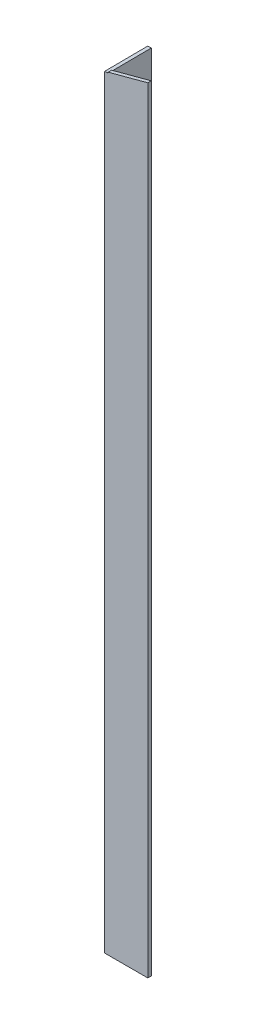
ISO-10303-21;
HEADER;
FILE_DESCRIPTION(('STEP AP214'),'2;1');
FILE_NAME('part.step','',(''),(''),'','','');
FILE_SCHEMA(('AUTOMOTIVE_DESIGN { 1 0 10303 214 1 1 1 1 }'));
ENDSEC;
DATA;
#1=APPLICATION_CONTEXT('core data for automotive mechanical design processes');
#2=APPLICATION_PROTOCOL_DEFINITION('international standard','automotive_design',2000,#1);
#3=PRODUCT_CONTEXT('',#1,'mechanical');
#4=PRODUCT('Part','Part','',(#3));
#5=PRODUCT_RELATED_PRODUCT_CATEGORY('part','',(#4));
#6=PRODUCT_DEFINITION_FORMATION('','',#4);
#7=PRODUCT_DEFINITION_CONTEXT('part definition',#1,'design');
#8=PRODUCT_DEFINITION('design','',#6,#7);
#9=PRODUCT_DEFINITION_SHAPE('','',#8);
#10=(LENGTH_UNIT() NAMED_UNIT(*) SI_UNIT(.MILLI.,.METRE.));
#11=(NAMED_UNIT(*) PLANE_ANGLE_UNIT() SI_UNIT($,.RADIAN.));
#12=(NAMED_UNIT(*) SI_UNIT($,.STERADIAN.) SOLID_ANGLE_UNIT());
#13=UNCERTAINTY_MEASURE_WITH_UNIT(LENGTH_MEASURE(1.E-05),#10,'distance_accuracy_value','');
#14=(GEOMETRIC_REPRESENTATION_CONTEXT(3) GLOBAL_UNCERTAINTY_ASSIGNED_CONTEXT((#13)) GLOBAL_UNIT_ASSIGNED_CONTEXT((#10,
#11,#12)) REPRESENTATION_CONTEXT('',''));
#15=CARTESIAN_POINT('',(0.,0.,0.));
#16=DIRECTION('',(0.,0.,1.));
#17=DIRECTION('',(1.,0.,0.));
#18=AXIS2_PLACEMENT_3D('',#15,#16,#17);
#19=CARTESIAN_POINT('',(50.,900.,-4.));
#20=DIRECTION('',(0.258819045102515,-0.96592582628907,0.));
#21=DIRECTION('',(0.96592582628907,0.258819045102515,0.));
#22=AXIS2_PLACEMENT_3D('',#19,#20,#21);
#23=PLANE('',#22);
#24=DIRECTION('',(0.,0.,-1.));
#25=VECTOR('',#24,1.);
#26=CARTESIAN_POINT('',(4.,887.674337148169,-4.));
#27=LINE('',#26,#25);
#28=CARTESIAN_POINT('',(4.,887.674337148169,0.));
#29=VERTEX_POINT('',#28);
#30=CARTESIAN_POINT('',(4.,887.674337148169,-4.));
#31=VERTEX_POINT('',#30);
#32=EDGE_CURVE('E181',#29,#31,#27,.T.);
#33=ORIENTED_EDGE('',*,*,#32,.F.);
#34=DIRECTION('',(0.96592582628907,0.258819045102515,0.));
#35=VECTOR('',#34,1.);
#36=CARTESIAN_POINT('',(50.,900.,0.));
#37=LINE('',#36,#35);
#38=CARTESIAN_POINT('',(50.,900.,0.));
#39=VERTEX_POINT('',#38);
#40=EDGE_CURVE('E171',#29,#39,#37,.T.);
#41=ORIENTED_EDGE('',*,*,#40,.T.);
#42=DIRECTION('',(0.,0.,1.));
#43=VECTOR('',#42,1.);
#44=CARTESIAN_POINT('',(50.,900.,-4.));
#45=LINE('',#44,#43);
#46=CARTESIAN_POINT('',(50.,900.,-4.));
#47=VERTEX_POINT('',#46);
#48=EDGE_CURVE('E147',#47,#39,#45,.T.);
#49=ORIENTED_EDGE('',*,*,#48,.F.);
#50=DIRECTION('',(0.96592582628907,0.258819045102515,0.));
#51=VECTOR('',#50,1.);
#52=CARTESIAN_POINT('',(50.,900.,-4.));
#53=LINE('',#52,#51);
#54=EDGE_CURVE('E177',#31,#47,#53,.T.);
#55=ORIENTED_EDGE('',*,*,#54,.F.);
#56=EDGE_LOOP('',(#33,#41,#49,#55));
#57=FACE_BOUND('',#56,.T.);
#58=ADVANCED_FACE('F36',(#57),#23,.F.);
#59=CARTESIAN_POINT('',(0.,900.,0.));
#60=DIRECTION('',(0.,0.,-1.));
#61=DIRECTION('',(-1.,0.,0.));
#62=AXIS2_PLACEMENT_3D('',#59,#60,#61);
#63=PLANE('',#62);
#64=DIRECTION('',(0.,1.,0.));
#65=VECTOR('',#64,1.);
#66=CARTESIAN_POINT('',(4.,886.602540378444,0.));
#67=LINE('',#66,#65);
#68=CARTESIAN_POINT('',(4.,886.602540378444,0.));
#69=VERTEX_POINT('',#68);
#70=EDGE_CURVE('E184',#69,#29,#67,.T.);
#71=ORIENTED_EDGE('',*,*,#70,.F.);
#72=DIRECTION('',(-1.,0.,0.));
#73=VECTOR('',#72,1.);
#74=CARTESIAN_POINT('',(4.,886.602540378444,0.));
#75=LINE('',#74,#73);
#76=CARTESIAN_POINT('',(0.,886.602540378444,0.));
#77=VERTEX_POINT('',#76);
#78=EDGE_CURVE('E124',#69,#77,#75,.T.);
#79=ORIENTED_EDGE('',*,*,#78,.T.);
#80=DIRECTION('',(0.,-1.,0.));
#81=VECTOR('',#80,1.);
#82=CARTESIAN_POINT('',(0.,900.,0.));
#83=LINE('',#82,#81);
#84=CARTESIAN_POINT('',(0.,0.,0.));
#85=VERTEX_POINT('',#84);
#86=EDGE_CURVE('E58',#77,#85,#83,.T.);
#87=ORIENTED_EDGE('',*,*,#86,.T.);
#88=DIRECTION('',(1.,0.,0.));
#89=VECTOR('',#88,1.);
#90=CARTESIAN_POINT('',(0.,0.,0.));
#91=LINE('',#90,#89);
#92=CARTESIAN_POINT('',(50.,0.,0.));
#93=VERTEX_POINT('',#92);
#94=EDGE_CURVE('E150',#85,#93,#91,.T.);
#95=ORIENTED_EDGE('',*,*,#94,.T.);
#96=DIRECTION('',(0.,-1.,0.));
#97=VECTOR('',#96,1.);
#98=CARTESIAN_POINT('',(50.,900.,0.));
#99=LINE('',#98,#97);
#100=EDGE_CURVE('E44',#39,#93,#99,.T.);
#101=ORIENTED_EDGE('',*,*,#100,.F.);
#102=ORIENTED_EDGE('',*,*,#40,.F.);
#103=EDGE_LOOP('',(#71,#79,#87,#95,#101,#102));
#104=FACE_BOUND('',#103,.T.);
#105=ADVANCED_FACE('F38',(#104),#63,.F.);
#106=CARTESIAN_POINT('',(50.,900.,-4.));
#107=DIRECTION('',(1.,0.,0.));
#108=DIRECTION('',(0.,0.,-1.));
#109=AXIS2_PLACEMENT_3D('',#106,#107,#108);
#110=PLANE('',#109);
#111=DIRECTION('',(0.,0.,1.));
#112=VECTOR('',#111,1.);
#113=CARTESIAN_POINT('',(50.,0.,-4.));
#114=LINE('',#113,#112);
#115=CARTESIAN_POINT('',(50.,0.,-4.));
#116=VERTEX_POINT('',#115);
#117=EDGE_CURVE('E145',#116,#93,#114,.T.);
#118=ORIENTED_EDGE('',*,*,#117,.F.);
#119=DIRECTION('',(0.,-1.,0.));
#120=VECTOR('',#119,1.);
#121=CARTESIAN_POINT('',(50.,900.,-4.));
#122=LINE('',#121,#120);
#123=EDGE_CURVE('E137',#47,#116,#122,.T.);
#124=ORIENTED_EDGE('',*,*,#123,.F.);
#125=ORIENTED_EDGE('',*,*,#48,.T.);
#126=ORIENTED_EDGE('',*,*,#100,.T.);
#127=EDGE_LOOP('',(#118,#124,#125,#126));
#128=FACE_BOUND('',#127,.T.);
#129=ADVANCED_FACE('F142',(#128),#110,.T.);
#130=CARTESIAN_POINT('',(0.,900.,-4.));
#131=DIRECTION('',(0.,0.,-1.));
#132=DIRECTION('',(-1.,0.,0.));
#133=AXIS2_PLACEMENT_3D('',#130,#131,#132);
#134=PLANE('',#133);
#135=ORIENTED_EDGE('',*,*,#54,.T.);
#136=ORIENTED_EDGE('',*,*,#123,.T.);
#137=DIRECTION('',(1.,0.,0.));
#138=VECTOR('',#137,1.);
#139=CARTESIAN_POINT('',(0.,0.,-4.));
#140=LINE('',#139,#138);
#141=CARTESIAN_POINT('',(4.,0.,-4.));
#142=VERTEX_POINT('',#141);
#143=EDGE_CURVE('E158',#142,#116,#140,.T.);
#144=ORIENTED_EDGE('',*,*,#143,.F.);
#145=DIRECTION('',(0.,-1.,0.));
#146=VECTOR('',#145,1.);
#147=CARTESIAN_POINT('',(4.,900.,-4.));
#148=LINE('',#147,#146);
#149=CARTESIAN_POINT('',(4.,886.634337148169,-4.));
#150=VERTEX_POINT('',#149);
#151=EDGE_CURVE('E130',#150,#142,#148,.T.);
#152=ORIENTED_EDGE('',*,*,#151,.F.);
#153=EDGE_CURVE('E132',#31,#150,#148,.T.);
#154=ORIENTED_EDGE('',*,*,#153,.F.);
#155=EDGE_LOOP('',(#135,#136,#144,#152,#154));
#156=FACE_BOUND('',#155,.T.);
#157=ADVANCED_FACE('F194',(#156),#134,.T.);
#158=CARTESIAN_POINT('',(4.,900.,-50.));
#159=DIRECTION('',(1.,0.,0.));
#160=DIRECTION('',(0.,0.,-1.));
#161=AXIS2_PLACEMENT_3D('',#158,#159,#160);
#162=PLANE('',#161);
#163=DIRECTION('',(0.,-0.00794894128963329,0.999968406667118));
#164=VECTOR('',#163,1.);
#165=CARTESIAN_POINT('',(4.,887.,-50.));
#166=LINE('',#165,#164);
#167=CARTESIAN_POINT('',(4.,887.,-50.));
#168=VERTEX_POINT('',#167);
#169=EDGE_CURVE('E107',#168,#150,#166,.T.);
#170=ORIENTED_EDGE('',*,*,#169,.T.);
#171=ORIENTED_EDGE('',*,*,#151,.T.);
#172=DIRECTION('',(0.,0.,1.));
#173=VECTOR('',#172,1.);
#174=CARTESIAN_POINT('',(4.,0.,-50.));
#175=LINE('',#174,#173);
#176=CARTESIAN_POINT('',(4.,0.,-50.));
#177=VERTEX_POINT('',#176);
#178=EDGE_CURVE('E128',#177,#142,#175,.T.);
#179=ORIENTED_EDGE('',*,*,#178,.F.);
#180=DIRECTION('',(0.,-1.,0.));
#181=VECTOR('',#180,1.);
#182=CARTESIAN_POINT('',(4.,900.,-50.));
#183=LINE('',#182,#181);
#184=EDGE_CURVE('E121',#168,#177,#183,.T.);
#185=ORIENTED_EDGE('',*,*,#184,.F.);
#186=EDGE_LOOP('',(#170,#171,#179,#185));
#187=FACE_BOUND('',#186,.T.);
#188=ADVANCED_FACE('F126',(#187),#162,.T.);
#189=CARTESIAN_POINT('',(0.,900.,-50.));
#190=DIRECTION('',(0.,0.,-1.));
#191=DIRECTION('',(-1.,0.,0.));
#192=AXIS2_PLACEMENT_3D('',#189,#190,#191);
#193=PLANE('',#192);
#194=DIRECTION('',(-1.,0.,0.));
#195=VECTOR('',#194,1.);
#196=CARTESIAN_POINT('',(4.,887.,-50.));
#197=LINE('',#196,#195);
#198=CARTESIAN_POINT('',(0.,887.,-50.));
#199=VERTEX_POINT('',#198);
#200=EDGE_CURVE('E111',#168,#199,#197,.T.);
#201=ORIENTED_EDGE('',*,*,#200,.F.);
#202=ORIENTED_EDGE('',*,*,#184,.T.);
#203=DIRECTION('',(1.,0.,0.));
#204=VECTOR('',#203,1.);
#205=CARTESIAN_POINT('',(0.,0.,-50.));
#206=LINE('',#205,#204);
#207=CARTESIAN_POINT('',(0.,0.,-50.));
#208=VERTEX_POINT('',#207);
#209=EDGE_CURVE('E164',#208,#177,#206,.T.);
#210=ORIENTED_EDGE('',*,*,#209,.F.);
#211=DIRECTION('',(0.,-1.,0.));
#212=VECTOR('',#211,1.);
#213=CARTESIAN_POINT('',(0.,900.,-50.));
#214=LINE('',#213,#212);
#215=EDGE_CURVE('E123',#199,#208,#214,.T.);
#216=ORIENTED_EDGE('',*,*,#215,.F.);
#217=EDGE_LOOP('',(#201,#202,#210,#216));
#218=FACE_BOUND('',#217,.T.);
#219=ADVANCED_FACE('F119',(#218),#193,.T.);
#220=CARTESIAN_POINT('',(0.,900.,-50.));
#221=DIRECTION('',(1.,0.,0.));
#222=DIRECTION('',(0.,0.,-1.));
#223=AXIS2_PLACEMENT_3D('',#220,#221,#222);
#224=PLANE('',#223);
#225=DIRECTION('',(0.,-1.,0.));
#226=VECTOR('',#225,1.);
#227=CARTESIAN_POINT('',(0.,886.602540378444,-4.));
#228=LINE('',#227,#226);
#229=CARTESIAN_POINT('',(0.,886.634337148169,-4.));
#230=VERTEX_POINT('',#229);
#231=CARTESIAN_POINT('',(0.,886.602540378444,-4.));
#232=VERTEX_POINT('',#231);
#233=EDGE_CURVE('E173',#230,#232,#228,.T.);
#234=ORIENTED_EDGE('',*,*,#233,.F.);
#235=DIRECTION('',(0.,-0.00794894128963329,0.999968406667118));
#236=VECTOR('',#235,1.);
#237=CARTESIAN_POINT('',(0.,887.,-50.));
#238=LINE('',#237,#236);
#239=EDGE_CURVE('E51',#199,#230,#238,.T.);
#240=ORIENTED_EDGE('',*,*,#239,.F.);
#241=ORIENTED_EDGE('',*,*,#215,.T.);
#242=DIRECTION('',(0.,0.,1.));
#243=VECTOR('',#242,1.);
#244=CARTESIAN_POINT('',(0.,0.,-50.));
#245=LINE('',#244,#243);
#246=EDGE_CURVE('E166',#208,#85,#245,.T.);
#247=ORIENTED_EDGE('',*,*,#246,.T.);
#248=ORIENTED_EDGE('',*,*,#86,.F.);
#249=DIRECTION('',(0.,0.,1.));
#250=VECTOR('',#249,1.);
#251=CARTESIAN_POINT('',(0.,886.602540378444,-4.));
#252=LINE('',#251,#250);
#253=EDGE_CURVE('E154',#232,#77,#252,.T.);
#254=ORIENTED_EDGE('',*,*,#253,.F.);
#255=EDGE_LOOP('',(#234,#240,#241,#247,#248,#254));
#256=FACE_BOUND('',#255,.T.);
#257=ADVANCED_FACE('F197',(#256),#224,.F.);
#258=CARTESIAN_POINT('',(0.,0.,0.));
#259=DIRECTION('',(0.,-1.,0.));
#260=DIRECTION('',(-1.,0.,0.));
#261=AXIS2_PLACEMENT_3D('',#258,#259,#260);
#262=PLANE('',#261);
#263=ORIENTED_EDGE('',*,*,#94,.F.);
#264=ORIENTED_EDGE('',*,*,#246,.F.);
#265=ORIENTED_EDGE('',*,*,#209,.T.);
#266=ORIENTED_EDGE('',*,*,#178,.T.);
#267=ORIENTED_EDGE('',*,*,#143,.T.);
#268=ORIENTED_EDGE('',*,*,#117,.T.);
#269=EDGE_LOOP('',(#263,#264,#265,#266,#267,#268));
#270=FACE_BOUND('',#269,.T.);
#271=ADVANCED_FACE('F156',(#270),#262,.T.);
#272=ORIENTED_EDGE('',*,*,#253,.T.);
#273=DIRECTION('',(0.0296528074621562,0.00794544581280013,-0.99952867937866));
#274=VECTOR('',#273,1.);
#275=CARTESIAN_POINT('',(0.165676280907662,886.646933204118,-5.58457051567039));
#276=LINE('',#275,#274);
#277=CARTESIAN_POINT('',(0.118667160128122,886.634337148169,-4.));
#278=VERTEX_POINT('',#277);
#279=EDGE_CURVE('E174',#77,#278,#276,.T.);
#280=ORIENTED_EDGE('',*,*,#279,.T.);
#281=EDGE_CURVE('E170',#232,#278,#53,.T.);
#282=ORIENTED_EDGE('',*,*,#281,.F.);
#283=EDGE_LOOP('',(#272,#280,#282));
#284=FACE_BOUND('',#283,.T.);
#285=ADVANCED_FACE('F203',(#284),#23,.F.);
#286=CARTESIAN_POINT('',(0.,0.,-4.));
#287=DIRECTION('',(0.,0.,-1.));
#288=DIRECTION('',(-1.,0.,0.));
#289=AXIS2_PLACEMENT_3D('',#286,#287,#288);
#290=PLANE('',#289);
#291=ORIENTED_EDGE('',*,*,#281,.T.);
#292=DIRECTION('',(-1.,0.,0.));
#293=VECTOR('',#292,1.);
#294=CARTESIAN_POINT('',(0.,886.634337148169,-4.));
#295=LINE('',#294,#293);
#296=EDGE_CURVE('E11',#278,#230,#295,.T.);
#297=ORIENTED_EDGE('',*,*,#296,.T.);
#298=ORIENTED_EDGE('',*,*,#233,.T.);
#299=EDGE_LOOP('',(#291,#297,#298));
#300=FACE_BOUND('',#299,.T.);
#301=ADVANCED_FACE('F201',(#300),#290,.F.);
#302=CARTESIAN_POINT('',(4.,887.,-50.));
#303=DIRECTION('',(0.,-0.999968406667118,-0.00794894128963329));
#304=DIRECTION('',(0.,0.00794894128963329,-0.999968406667118));
#305=AXIS2_PLACEMENT_3D('',#302,#303,#304);
#306=PLANE('',#305);
#307=ORIENTED_EDGE('',*,*,#78,.F.);
#308=EDGE_CURVE('E112',#150,#69,#166,.T.);
#309=ORIENTED_EDGE('',*,*,#308,.F.);
#310=ORIENTED_EDGE('',*,*,#169,.F.);
#311=ORIENTED_EDGE('',*,*,#200,.T.);
#312=ORIENTED_EDGE('',*,*,#239,.T.);
#313=ORIENTED_EDGE('',*,*,#296,.F.);
#314=ORIENTED_EDGE('',*,*,#279,.F.);
#315=EDGE_LOOP('',(#307,#309,#310,#311,#312,#313,#314));
#316=FACE_BOUND('',#315,.T.);
#317=ADVANCED_FACE('F110',(#316),#306,.F.);
#318=CARTESIAN_POINT('',(4.,0.,0.));
#319=DIRECTION('',(-1.,0.,0.));
#320=DIRECTION('',(0.,0.,1.));
#321=AXIS2_PLACEMENT_3D('',#318,#319,#320);
#322=PLANE('',#321);
#323=ORIENTED_EDGE('',*,*,#308,.T.);
#324=ORIENTED_EDGE('',*,*,#70,.T.);
#325=ORIENTED_EDGE('',*,*,#32,.T.);
#326=ORIENTED_EDGE('',*,*,#153,.T.);
#327=EDGE_LOOP('',(#323,#324,#325,#326));
#328=FACE_BOUND('',#327,.T.);
#329=ADVANCED_FACE('F188',(#328),#322,.T.);
#330=CLOSED_SHELL('',(#58,#105,#129,#157,#188,#219,#257,#271,#285,#301,#317,#329));
#331=MANIFOLD_SOLID_BREP('B2',#330);
#332=ADVANCED_BREP_SHAPE_REPRESENTATION('',(#18,#331),#14);
#333=SHAPE_DEFINITION_REPRESENTATION(#9,#332);
ENDSEC;
END-ISO-10303-21;
